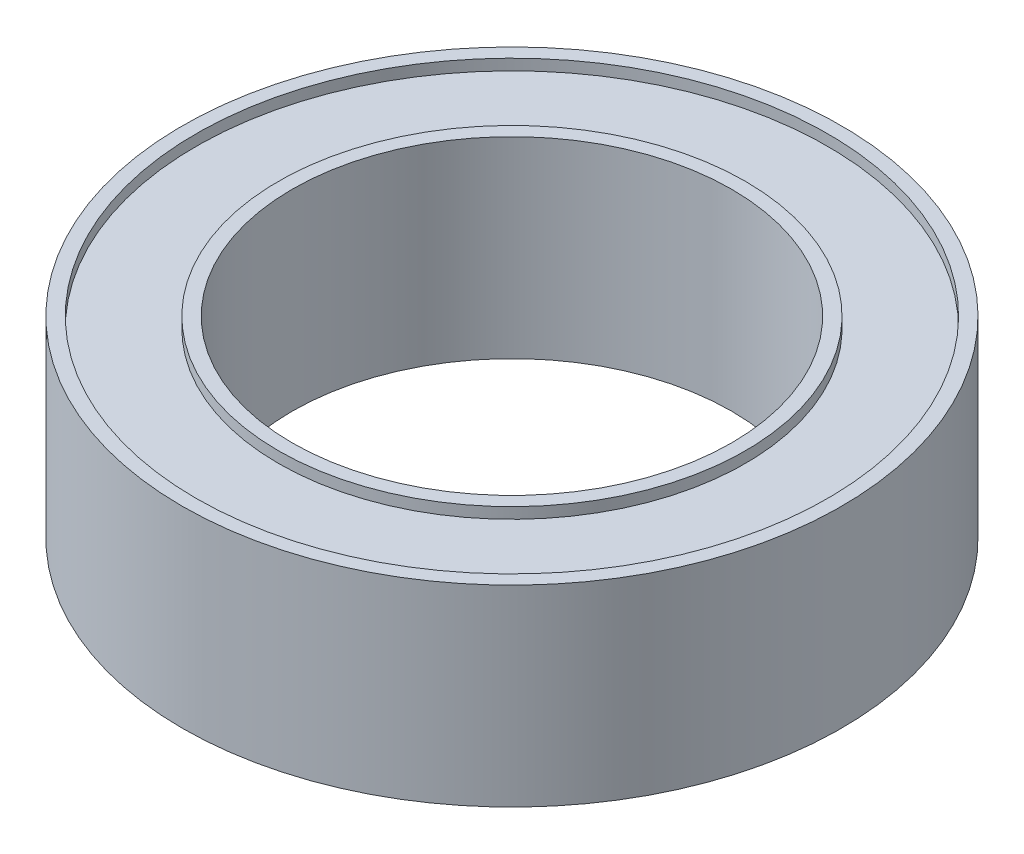
ISO-10303-21;
HEADER;
FILE_DESCRIPTION(('STEP AP214'),'2;1');
FILE_NAME('part.step','',(''),(''),'','','');
FILE_SCHEMA(('AUTOMOTIVE_DESIGN { 1 0 10303 214 1 1 1 1 }'));
ENDSEC;
DATA;
#1=APPLICATION_CONTEXT('core data for automotive mechanical design processes');
#2=APPLICATION_PROTOCOL_DEFINITION('international standard','automotive_design',2000,#1);
#3=PRODUCT_CONTEXT('',#1,'mechanical');
#4=PRODUCT('Part','Part','',(#3));
#5=PRODUCT_RELATED_PRODUCT_CATEGORY('part','',(#4));
#6=PRODUCT_DEFINITION_FORMATION('','',#4);
#7=PRODUCT_DEFINITION_CONTEXT('part definition',#1,'design');
#8=PRODUCT_DEFINITION('design','',#6,#7);
#9=PRODUCT_DEFINITION_SHAPE('','',#8);
#10=(LENGTH_UNIT() NAMED_UNIT(*) SI_UNIT(.MILLI.,.METRE.));
#11=(NAMED_UNIT(*) PLANE_ANGLE_UNIT() SI_UNIT($,.RADIAN.));
#12=(NAMED_UNIT(*) SI_UNIT($,.STERADIAN.) SOLID_ANGLE_UNIT());
#13=UNCERTAINTY_MEASURE_WITH_UNIT(LENGTH_MEASURE(1.E-05),#10,'distance_accuracy_value','');
#14=(GEOMETRIC_REPRESENTATION_CONTEXT(3) GLOBAL_UNCERTAINTY_ASSIGNED_CONTEXT((#13)) GLOBAL_UNIT_ASSIGNED_CONTEXT((#10,
#11,#12)) REPRESENTATION_CONTEXT('',''));
#15=CARTESIAN_POINT('',(0.,0.,0.));
#16=DIRECTION('',(0.,0.,1.));
#17=DIRECTION('',(1.,0.,0.));
#18=AXIS2_PLACEMENT_3D('',#15,#16,#17);
#19=CARTESIAN_POINT('',(0.,0.,0.));
#20=DIRECTION('',(0.,1.,0.));
#21=DIRECTION('',(0.,0.,1.));
#22=AXIS2_PLACEMENT_3D('',#19,#20,#21);
#23=PLANE('',#22);
#24=CARTESIAN_POINT('',(0.,0.,0.));
#25=DIRECTION('',(0.,1.,0.));
#26=DIRECTION('',(0.,0.,1.));
#27=AXIS2_PLACEMENT_3D('',#24,#25,#26);
#28=CIRCLE('',#27,4.);
#29=CARTESIAN_POINT('',(0.,0.,4.));
#30=VERTEX_POINT('',#29);
#31=EDGE_CURVE('E51',#30,#30,#28,.T.);
#32=ORIENTED_EDGE('',*,*,#31,.T.);
#33=EDGE_LOOP('',(#32));
#34=FACE_BOUND('',#33,.T.);
#35=CARTESIAN_POINT('',(0.,0.,0.));
#36=DIRECTION('',(0.,1.,0.));
#37=DIRECTION('',(0.,0.,1.));
#38=AXIS2_PLACEMENT_3D('',#35,#36,#37);
#39=CIRCLE('',#38,4.25);
#40=CARTESIAN_POINT('',(0.,0.,4.25));
#41=VERTEX_POINT('',#40);
#42=EDGE_CURVE('E75',#41,#41,#39,.T.);
#43=ORIENTED_EDGE('',*,*,#42,.F.);
#44=EDGE_LOOP('',(#43));
#45=FACE_BOUND('',#44,.T.);
#46=ADVANCED_FACE('F38',(#34,#45),#23,.F.);
#47=CARTESIAN_POINT('',(0.,3.5,0.));
#48=DIRECTION('',(0.,1.,0.));
#49=DIRECTION('',(0.,0.,1.));
#50=AXIS2_PLACEMENT_3D('',#47,#48,#49);
#51=PLANE('',#50);
#52=CARTESIAN_POINT('',(0.,3.5,0.));
#53=DIRECTION('',(0.,1.,0.));
#54=DIRECTION('',(0.,0.,1.));
#55=AXIS2_PLACEMENT_3D('',#52,#53,#54);
#56=CIRCLE('',#55,4.);
#57=CARTESIAN_POINT('',(0.,3.5,4.));
#58=VERTEX_POINT('',#57);
#59=EDGE_CURVE('E49',#58,#58,#56,.T.);
#60=ORIENTED_EDGE('',*,*,#59,.F.);
#61=EDGE_LOOP('',(#60));
#62=FACE_BOUND('',#61,.T.);
#63=CARTESIAN_POINT('',(0.,3.5,0.));
#64=DIRECTION('',(0.,1.,0.));
#65=DIRECTION('',(0.,0.,1.));
#66=AXIS2_PLACEMENT_3D('',#63,#64,#65);
#67=CIRCLE('',#66,4.25);
#68=CARTESIAN_POINT('',(0.,3.5,4.25));
#69=VERTEX_POINT('',#68);
#70=EDGE_CURVE('E63',#69,#69,#67,.T.);
#71=ORIENTED_EDGE('',*,*,#70,.T.);
#72=EDGE_LOOP('',(#71));
#73=FACE_BOUND('',#72,.T.);
#74=ADVANCED_FACE('F91',(#62,#73),#51,.T.);
#75=CARTESIAN_POINT('',(0.,3.5,0.));
#76=DIRECTION('',(0.,1.,0.));
#77=DIRECTION('',(0.,0.,1.));
#78=AXIS2_PLACEMENT_3D('',#75,#76,#77);
#79=CIRCLE('',#78,5.75);
#80=CARTESIAN_POINT('',(0.,3.5,5.75));
#81=VERTEX_POINT('',#80);
#82=EDGE_CURVE('E57',#81,#81,#79,.T.);
#83=ORIENTED_EDGE('',*,*,#82,.F.);
#84=EDGE_LOOP('',(#83));
#85=FACE_BOUND('',#84,.T.);
#86=CARTESIAN_POINT('',(0.,3.5,0.));
#87=DIRECTION('',(0.,1.,0.));
#88=DIRECTION('',(0.,0.,1.));
#89=AXIS2_PLACEMENT_3D('',#86,#87,#88);
#90=CIRCLE('',#89,6.);
#91=CARTESIAN_POINT('',(0.,3.5,6.));
#92=VERTEX_POINT('',#91);
#93=EDGE_CURVE('E10',#92,#92,#90,.T.);
#94=ORIENTED_EDGE('',*,*,#93,.T.);
#95=EDGE_LOOP('',(#94));
#96=FACE_BOUND('',#95,.T.);
#97=ADVANCED_FACE('F97',(#85,#96),#51,.T.);
#98=CARTESIAN_POINT('',(0.,0.,0.));
#99=DIRECTION('',(0.,1.,0.));
#100=DIRECTION('',(0.,0.,1.));
#101=AXIS2_PLACEMENT_3D('',#98,#99,#100);
#102=CIRCLE('',#101,5.75);
#103=CARTESIAN_POINT('',(0.,0.,5.75));
#104=VERTEX_POINT('',#103);
#105=EDGE_CURVE('E69',#104,#104,#102,.T.);
#106=ORIENTED_EDGE('',*,*,#105,.T.);
#107=EDGE_LOOP('',(#106));
#108=FACE_BOUND('',#107,.T.);
#109=CARTESIAN_POINT('',(0.,0.,0.));
#110=DIRECTION('',(0.,1.,0.));
#111=DIRECTION('',(0.,0.,1.));
#112=AXIS2_PLACEMENT_3D('',#109,#110,#111);
#113=CIRCLE('',#112,6.);
#114=CARTESIAN_POINT('',(0.,0.,6.));
#115=VERTEX_POINT('',#114);
#116=EDGE_CURVE('E42',#115,#115,#113,.T.);
#117=ORIENTED_EDGE('',*,*,#116,.F.);
#118=EDGE_LOOP('',(#117));
#119=FACE_BOUND('',#118,.T.);
#120=ADVANCED_FACE('F93',(#108,#119),#23,.F.);
#121=CARTESIAN_POINT('',(0.,3.5,0.));
#122=DIRECTION('',(0.,-1.,0.));
#123=DIRECTION('',(0.,0.,-1.));
#124=AXIS2_PLACEMENT_3D('',#121,#122,#123);
#125=CYLINDRICAL_SURFACE('',#124,6.);
#126=ORIENTED_EDGE('',*,*,#93,.F.);
#127=EDGE_LOOP('',(#126));
#128=FACE_BOUND('',#127,.T.);
#129=ORIENTED_EDGE('',*,*,#116,.T.);
#130=EDGE_LOOP('',(#129));
#131=FACE_BOUND('',#130,.T.);
#132=ADVANCED_FACE('F40',(#128,#131),#125,.T.);
#133=CARTESIAN_POINT('',(0.,3.5,0.));
#134=DIRECTION('',(0.,-1.,0.));
#135=DIRECTION('',(0.,0.,-1.));
#136=AXIS2_PLACEMENT_3D('',#133,#134,#135);
#137=CYLINDRICAL_SURFACE('',#136,4.);
#138=ORIENTED_EDGE('',*,*,#59,.T.);
#139=EDGE_LOOP('',(#138));
#140=FACE_BOUND('',#139,.T.);
#141=ORIENTED_EDGE('',*,*,#31,.F.);
#142=EDGE_LOOP('',(#141));
#143=FACE_BOUND('',#142,.T.);
#144=ADVANCED_FACE('F106',(#140,#143),#137,.F.);
#145=CARTESIAN_POINT('',(0.,3.3,0.));
#146=DIRECTION('',(0.,1.,0.));
#147=DIRECTION('',(0.,0.,1.));
#148=AXIS2_PLACEMENT_3D('',#145,#146,#147);
#149=CYLINDRICAL_SURFACE('',#148,5.75);
#150=CARTESIAN_POINT('',(0.,3.3,0.));
#151=DIRECTION('',(0.,1.,0.));
#152=DIRECTION('',(0.,0.,1.));
#153=AXIS2_PLACEMENT_3D('',#150,#151,#152);
#154=CIRCLE('',#153,5.75);
#155=CARTESIAN_POINT('',(0.,3.3,5.75));
#156=VERTEX_POINT('',#155);
#157=EDGE_CURVE('E54',#156,#156,#154,.T.);
#158=ORIENTED_EDGE('',*,*,#157,.F.);
#159=EDGE_LOOP('',(#158));
#160=FACE_BOUND('',#159,.T.);
#161=ORIENTED_EDGE('',*,*,#82,.T.);
#162=EDGE_LOOP('',(#161));
#163=FACE_BOUND('',#162,.T.);
#164=ADVANCED_FACE('F130',(#160,#163),#149,.F.);
#165=CARTESIAN_POINT('',(0.,3.3,0.));
#166=DIRECTION('',(0.,1.,0.));
#167=DIRECTION('',(0.,0.,1.));
#168=AXIS2_PLACEMENT_3D('',#165,#166,#167);
#169=PLANE('',#168);
#170=CARTESIAN_POINT('',(0.,3.3,0.));
#171=DIRECTION('',(0.,1.,0.));
#172=DIRECTION('',(0.,0.,1.));
#173=AXIS2_PLACEMENT_3D('',#170,#171,#172);
#174=CIRCLE('',#173,4.25);
#175=CARTESIAN_POINT('',(0.,3.3,4.25));
#176=VERTEX_POINT('',#175);
#177=EDGE_CURVE('E60',#176,#176,#174,.T.);
#178=ORIENTED_EDGE('',*,*,#177,.F.);
#179=EDGE_LOOP('',(#178));
#180=FACE_BOUND('',#179,.T.);
#181=ORIENTED_EDGE('',*,*,#157,.T.);
#182=EDGE_LOOP('',(#181));
#183=FACE_BOUND('',#182,.T.);
#184=ADVANCED_FACE('F126',(#180,#183),#169,.T.);
#185=CARTESIAN_POINT('',(0.,3.3,0.));
#186=DIRECTION('',(0.,1.,0.));
#187=DIRECTION('',(0.,0.,1.));
#188=AXIS2_PLACEMENT_3D('',#185,#186,#187);
#189=CYLINDRICAL_SURFACE('',#188,4.25);
#190=ORIENTED_EDGE('',*,*,#177,.T.);
#191=EDGE_LOOP('',(#190));
#192=FACE_BOUND('',#191,.T.);
#193=ORIENTED_EDGE('',*,*,#70,.F.);
#194=EDGE_LOOP('',(#193));
#195=FACE_BOUND('',#194,.T.);
#196=ADVANCED_FACE('F120',(#192,#195),#189,.T.);
#197=CARTESIAN_POINT('',(0.,0.2,0.));
#198=DIRECTION('',(0.,1.,0.));
#199=DIRECTION('',(0.,0.,1.));
#200=AXIS2_PLACEMENT_3D('',#197,#198,#199);
#201=PLANE('',#200);
#202=CARTESIAN_POINT('',(0.,0.2,0.));
#203=DIRECTION('',(0.,1.,0.));
#204=DIRECTION('',(0.,0.,1.));
#205=AXIS2_PLACEMENT_3D('',#202,#203,#204);
#206=CIRCLE('',#205,5.75);
#207=CARTESIAN_POINT('',(0.,0.2,5.75));
#208=VERTEX_POINT('',#207);
#209=EDGE_CURVE('E66',#208,#208,#206,.T.);
#210=ORIENTED_EDGE('',*,*,#209,.F.);
#211=EDGE_LOOP('',(#210));
#212=FACE_BOUND('',#211,.T.);
#213=CARTESIAN_POINT('',(0.,0.2,0.));
#214=DIRECTION('',(0.,1.,0.));
#215=DIRECTION('',(0.,0.,1.));
#216=AXIS2_PLACEMENT_3D('',#213,#214,#215);
#217=CIRCLE('',#216,4.25);
#218=CARTESIAN_POINT('',(0.,0.2,4.25));
#219=VERTEX_POINT('',#218);
#220=EDGE_CURVE('E72',#219,#219,#217,.T.);
#221=ORIENTED_EDGE('',*,*,#220,.T.);
#222=EDGE_LOOP('',(#221));
#223=FACE_BOUND('',#222,.T.);
#224=ADVANCED_FACE('F81',(#212,#223),#201,.F.);
#225=CARTESIAN_POINT('',(0.,0.2,0.));
#226=DIRECTION('',(0.,-1.,0.));
#227=DIRECTION('',(0.,0.,-1.));
#228=AXIS2_PLACEMENT_3D('',#225,#226,#227);
#229=CYLINDRICAL_SURFACE('',#228,5.75);
#230=ORIENTED_EDGE('',*,*,#209,.T.);
#231=EDGE_LOOP('',(#230));
#232=FACE_BOUND('',#231,.T.);
#233=ORIENTED_EDGE('',*,*,#105,.F.);
#234=EDGE_LOOP('',(#233));
#235=FACE_BOUND('',#234,.T.);
#236=ADVANCED_FACE('F86',(#232,#235),#229,.F.);
#237=CARTESIAN_POINT('',(0.,0.2,0.));
#238=DIRECTION('',(0.,-1.,0.));
#239=DIRECTION('',(0.,0.,-1.));
#240=AXIS2_PLACEMENT_3D('',#237,#238,#239);
#241=CYLINDRICAL_SURFACE('',#240,4.25);
#242=ORIENTED_EDGE('',*,*,#220,.F.);
#243=EDGE_LOOP('',(#242));
#244=FACE_BOUND('',#243,.T.);
#245=ORIENTED_EDGE('',*,*,#42,.T.);
#246=EDGE_LOOP('',(#245));
#247=FACE_BOUND('',#246,.T.);
#248=ADVANCED_FACE('F83',(#244,#247),#241,.T.);
#249=CLOSED_SHELL('',(#46,#74,#97,#120,#132,#144,#164,#184,#196,#224,#236,#248));
#250=MANIFOLD_SOLID_BREP('B2',#249);
#251=ADVANCED_BREP_SHAPE_REPRESENTATION('',(#18,#250),#14);
#252=SHAPE_DEFINITION_REPRESENTATION(#9,#251);
ENDSEC;
END-ISO-10303-21;
